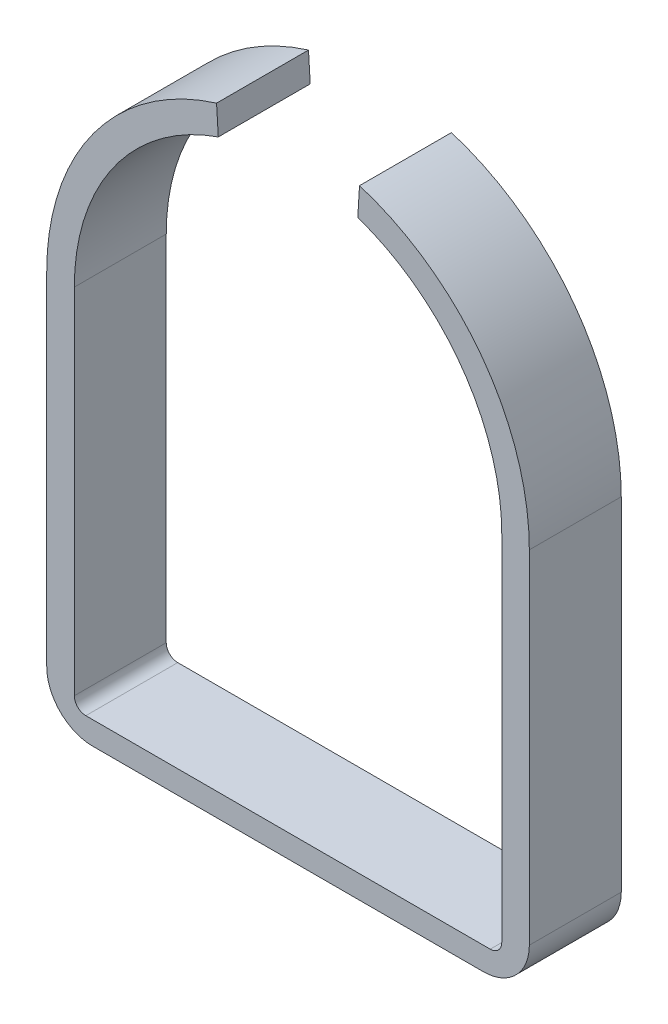
ISO-10303-21;
HEADER;
FILE_DESCRIPTION(('STEP AP214'),'2;1');
FILE_NAME('part.step','',(''),(''),'','','');
FILE_SCHEMA(('AUTOMOTIVE_DESIGN { 1 0 10303 214 1 1 1 1 }'));
ENDSEC;
DATA;
#1=APPLICATION_CONTEXT('core data for automotive mechanical design processes');
#2=APPLICATION_PROTOCOL_DEFINITION('international standard','automotive_design',2000,#1);
#3=PRODUCT_CONTEXT('',#1,'mechanical');
#4=PRODUCT('Part','Part','',(#3));
#5=PRODUCT_RELATED_PRODUCT_CATEGORY('part','',(#4));
#6=PRODUCT_DEFINITION_FORMATION('','',#4);
#7=PRODUCT_DEFINITION_CONTEXT('part definition',#1,'design');
#8=PRODUCT_DEFINITION('design','',#6,#7);
#9=PRODUCT_DEFINITION_SHAPE('','',#8);
#10=(LENGTH_UNIT() NAMED_UNIT(*) SI_UNIT(.MILLI.,.METRE.));
#11=(NAMED_UNIT(*) PLANE_ANGLE_UNIT() SI_UNIT($,.RADIAN.));
#12=(NAMED_UNIT(*) SI_UNIT($,.STERADIAN.) SOLID_ANGLE_UNIT());
#13=UNCERTAINTY_MEASURE_WITH_UNIT(LENGTH_MEASURE(1.E-05),#10,'distance_accuracy_value','');
#14=(GEOMETRIC_REPRESENTATION_CONTEXT(3) GLOBAL_UNCERTAINTY_ASSIGNED_CONTEXT((#13)) GLOBAL_UNIT_ASSIGNED_CONTEXT((#10,
#11,#12)) REPRESENTATION_CONTEXT('',''));
#15=CARTESIAN_POINT('',(0.,0.,0.));
#16=DIRECTION('',(0.,0.,1.));
#17=DIRECTION('',(1.,0.,0.));
#18=AXIS2_PLACEMENT_3D('',#15,#16,#17);
#19=CARTESIAN_POINT('',(0.,0.,56.8469714478884));
#20=DIRECTION('',(0.,0.,-1.));
#21=DIRECTION('',(-1.,0.,0.));
#22=AXIS2_PLACEMENT_3D('',#19,#20,#21);
#23=CYLINDRICAL_SURFACE('',#22,9.3);
#24=DIRECTION('',(0.,0.,-1.));
#25=VECTOR('',#24,1.);
#26=CARTESIAN_POINT('',(3.03467311666204,8.79094756411439,56.8469714478884));
#27=LINE('',#26,#25);
#28=CARTESIAN_POINT('',(3.03467311666204,8.79094756411439,1.5));
#29=VERTEX_POINT('',#28);
#30=CARTESIAN_POINT('',(3.03467311666204,8.79094756411439,5.5));
#31=VERTEX_POINT('',#30);
#32=EDGE_CURVE('E218',#29,#31,#27,.F.);
#33=ORIENTED_EDGE('',*,*,#32,.F.);
#34=CARTESIAN_POINT('',(0.,0.,1.5));
#35=DIRECTION('',(0.,0.,1.));
#36=DIRECTION('',(-1.,0.,0.));
#37=AXIS2_PLACEMENT_3D('',#34,#35,#36);
#38=CIRCLE('',#37,9.3);
#39=CARTESIAN_POINT('',(9.3,0.,1.5));
#40=VERTEX_POINT('',#39);
#41=EDGE_CURVE('E205',#40,#29,#38,.T.);
#42=ORIENTED_EDGE('',*,*,#41,.F.);
#43=DIRECTION('',(0.,0.,-1.));
#44=VECTOR('',#43,1.);
#45=CARTESIAN_POINT('',(9.3,0.,56.8469714478884));
#46=LINE('',#45,#44);
#47=CARTESIAN_POINT('',(9.3,0.,5.5));
#48=VERTEX_POINT('',#47);
#49=EDGE_CURVE('E266',#48,#40,#46,.T.);
#50=ORIENTED_EDGE('',*,*,#49,.F.);
#51=CARTESIAN_POINT('',(0.,0.,5.5));
#52=DIRECTION('',(0.,0.,1.));
#53=DIRECTION('',(1.,0.,0.));
#54=AXIS2_PLACEMENT_3D('',#51,#52,#53);
#55=CIRCLE('',#54,9.3);
#56=EDGE_CURVE('E231',#48,#31,#55,.T.);
#57=ORIENTED_EDGE('',*,*,#56,.T.);
#58=EDGE_LOOP('',(#33,#42,#50,#57));
#59=FACE_BOUND('',#58,.T.);
#60=ADVANCED_FACE('F44',(#59),#23,.F.);
#61=CARTESIAN_POINT('',(0.,0.,5.5));
#62=DIRECTION('',(0.,0.,1.));
#63=DIRECTION('',(1.,0.,0.));
#64=AXIS2_PLACEMENT_3D('',#61,#62,#63);
#65=PLANE('',#64);
#66=DIRECTION('',(0.,-1.,0.));
#67=VECTOR('',#66,1.);
#68=CARTESIAN_POINT('',(-10.5,0.,5.5));
#69=LINE('',#68,#67);
#70=CARTESIAN_POINT('',(-10.5,0.,5.5));
#71=VERTEX_POINT('',#70);
#72=CARTESIAN_POINT('',(-10.5,-14.900343897342,5.5));
#73=VERTEX_POINT('',#72);
#74=EDGE_CURVE('E174',#71,#73,#69,.T.);
#75=ORIENTED_EDGE('',*,*,#74,.T.);
#76=CARTESIAN_POINT('',(-8.5,-14.900343897342,5.5));
#77=DIRECTION('',(0.,0.,1.));
#78=DIRECTION('',(1.,0.,0.));
#79=AXIS2_PLACEMENT_3D('',#76,#77,#78);
#80=CIRCLE('',#79,2.);
#81=CARTESIAN_POINT('',(-8.5,-16.900343897342,5.5));
#82=VERTEX_POINT('',#81);
#83=EDGE_CURVE('E274',#73,#82,#80,.T.);
#84=ORIENTED_EDGE('',*,*,#83,.T.);
#85=DIRECTION('',(-1.,0.,0.));
#86=VECTOR('',#85,1.);
#87=CARTESIAN_POINT('',(-11.1726993556512,-16.900343897342,5.5));
#88=LINE('',#87,#86);
#89=CARTESIAN_POINT('',(8.5,-16.900343897342,5.5));
#90=VERTEX_POINT('',#89);
#91=EDGE_CURVE('E168',#90,#82,#88,.T.);
#92=ORIENTED_EDGE('',*,*,#91,.F.);
#93=CARTESIAN_POINT('',(8.5,-14.900343897342,5.5));
#94=DIRECTION('',(0.,0.,1.));
#95=DIRECTION('',(1.,0.,0.));
#96=AXIS2_PLACEMENT_3D('',#93,#94,#95);
#97=CIRCLE('',#96,2.);
#98=CARTESIAN_POINT('',(10.5,-14.900343897342,5.5));
#99=VERTEX_POINT('',#98);
#100=EDGE_CURVE('E272',#90,#99,#97,.T.);
#101=ORIENTED_EDGE('',*,*,#100,.T.);
#102=DIRECTION('',(0.,-1.,0.));
#103=VECTOR('',#102,1.);
#104=CARTESIAN_POINT('',(10.5,0.,5.5));
#105=LINE('',#104,#103);
#106=CARTESIAN_POINT('',(10.5,0.,5.5));
#107=VERTEX_POINT('',#106);
#108=EDGE_CURVE('E235',#107,#99,#105,.T.);
#109=ORIENTED_EDGE('',*,*,#108,.F.);
#110=CARTESIAN_POINT('',(0.,0.,5.5));
#111=DIRECTION('',(0.,0.,1.));
#112=DIRECTION('',(1.,0.,0.));
#113=AXIS2_PLACEMENT_3D('',#110,#111,#112);
#114=CIRCLE('',#113,10.5);
#115=CARTESIAN_POINT('',(3.11032664956738,10.0287520725657,5.5));
#116=VERTEX_POINT('',#115);
#117=EDGE_CURVE('E237',#116,#107,#114,.F.);
#118=ORIENTED_EDGE('',*,*,#117,.F.);
#119=DIRECTION('',(-0.0610052906976046,-0.998137442693591,0.));
#120=VECTOR('',#119,1.);
#121=CARTESIAN_POINT('',(2.48808370636675,-0.15206950796001,5.5));
#122=LINE('',#121,#120);
#123=EDGE_CURVE('E242',#116,#31,#122,.T.);
#124=ORIENTED_EDGE('',*,*,#123,.T.);
#125=ORIENTED_EDGE('',*,*,#56,.F.);
#126=DIRECTION('',(0.,1.,0.));
#127=VECTOR('',#126,1.);
#128=CARTESIAN_POINT('',(9.3,0.,5.5));
#129=LINE('',#128,#127);
#130=CARTESIAN_POINT('',(9.3,-15.4,5.5));
#131=VERTEX_POINT('',#130);
#132=EDGE_CURVE('E229',#131,#48,#129,.T.);
#133=ORIENTED_EDGE('',*,*,#132,.F.);
#134=CARTESIAN_POINT('',(8.8,-15.4,5.5));
#135=DIRECTION('',(0.,0.,1.));
#136=DIRECTION('',(1.,0.,0.));
#137=AXIS2_PLACEMENT_3D('',#134,#135,#136);
#138=CIRCLE('',#137,0.5);
#139=CARTESIAN_POINT('',(8.8,-15.9,5.5));
#140=VERTEX_POINT('',#139);
#141=EDGE_CURVE('E248',#131,#140,#138,.F.);
#142=ORIENTED_EDGE('',*,*,#141,.T.);
#143=DIRECTION('',(1.,0.,0.));
#144=VECTOR('',#143,1.);
#145=CARTESIAN_POINT('',(0.,-15.9,5.5));
#146=LINE('',#145,#144);
#147=CARTESIAN_POINT('',(-8.8,-15.9,5.5));
#148=VERTEX_POINT('',#147);
#149=EDGE_CURVE('E226',#148,#140,#146,.T.);
#150=ORIENTED_EDGE('',*,*,#149,.F.);
#151=CARTESIAN_POINT('',(-8.8,-15.4,5.5));
#152=DIRECTION('',(0.,0.,1.));
#153=DIRECTION('',(1.,0.,0.));
#154=AXIS2_PLACEMENT_3D('',#151,#152,#153);
#155=CIRCLE('',#154,0.5);
#156=CARTESIAN_POINT('',(-9.3,-15.4,5.5));
#157=VERTEX_POINT('',#156);
#158=EDGE_CURVE('E221',#148,#157,#155,.F.);
#159=ORIENTED_EDGE('',*,*,#158,.T.);
#160=DIRECTION('',(0.,-1.,0.));
#161=VECTOR('',#160,1.);
#162=CARTESIAN_POINT('',(-9.3,-15.9,5.5));
#163=LINE('',#162,#161);
#164=CARTESIAN_POINT('',(-9.3,0.,5.5));
#165=VERTEX_POINT('',#164);
#166=EDGE_CURVE('E222',#165,#157,#163,.T.);
#167=ORIENTED_EDGE('',*,*,#166,.F.);
#168=CARTESIAN_POINT('',(-3.03467311644218,8.79094756419029,5.5));
#169=VERTEX_POINT('',#168);
#170=EDGE_CURVE('E234',#169,#165,#55,.T.);
#171=ORIENTED_EDGE('',*,*,#170,.F.);
#172=DIRECTION('',(-0.0610052909139107,0.99813744268037,0.));
#173=VECTOR('',#172,1.);
#174=CARTESIAN_POINT('',(-2.48808370417207,-0.152069508367079,5.5));
#175=LINE('',#174,#173);
#176=CARTESIAN_POINT('',(-3.11032664961128,10.0287520725521,5.5));
#177=VERTEX_POINT('',#176);
#178=EDGE_CURVE('E244',#169,#177,#175,.T.);
#179=ORIENTED_EDGE('',*,*,#178,.T.);
#180=CARTESIAN_POINT('',(0.,0.,5.5));
#181=DIRECTION('',(0.,0.,1.));
#182=DIRECTION('',(1.,0.,0.));
#183=AXIS2_PLACEMENT_3D('',#180,#181,#182);
#184=CIRCLE('',#183,10.5);
#185=EDGE_CURVE('E240',#71,#177,#184,.F.);
#186=ORIENTED_EDGE('',*,*,#185,.F.);
#187=EDGE_LOOP('',(#75,#84,#92,#101,#109,#118,#124,#125,#133,#142,#150,#159,#167,#171,#179,#186));
#188=FACE_BOUND('',#187,.T.);
#189=ADVANCED_FACE('F290',(#188),#65,.T.);
#190=DIRECTION('',(0.,0.,-1.));
#191=VECTOR('',#190,1.);
#192=CARTESIAN_POINT('',(-3.03467311644218,8.79094756419029,56.8469714478884));
#193=LINE('',#192,#191);
#194=CARTESIAN_POINT('',(-3.03467311644218,8.79094756419029,1.5));
#195=VERTEX_POINT('',#194);
#196=EDGE_CURVE('E216',#169,#195,#193,.T.);
#197=ORIENTED_EDGE('',*,*,#196,.F.);
#198=ORIENTED_EDGE('',*,*,#170,.T.);
#199=DIRECTION('',(0.,0.,-1.));
#200=VECTOR('',#199,1.);
#201=CARTESIAN_POINT('',(-9.3,0.,56.8469714478884));
#202=LINE('',#201,#200);
#203=CARTESIAN_POINT('',(-9.3,0.,1.5));
#204=VERTEX_POINT('',#203);
#205=EDGE_CURVE('E178',#165,#204,#202,.T.);
#206=ORIENTED_EDGE('',*,*,#205,.T.);
#207=CARTESIAN_POINT('',(0.,0.,1.5));
#208=DIRECTION('',(0.,0.,1.));
#209=DIRECTION('',(-1.,0.,0.));
#210=AXIS2_PLACEMENT_3D('',#207,#208,#209);
#211=CIRCLE('',#210,9.3);
#212=EDGE_CURVE('E184',#195,#204,#211,.T.);
#213=ORIENTED_EDGE('',*,*,#212,.F.);
#214=EDGE_LOOP('',(#197,#198,#206,#213));
#215=FACE_BOUND('',#214,.T.);
#216=ADVANCED_FACE('F298',(#215),#23,.F.);
#217=CARTESIAN_POINT('',(-9.3,-15.9,56.8469714478884));
#218=DIRECTION('',(1.,0.,0.));
#219=DIRECTION('',(0.,0.,-1.));
#220=AXIS2_PLACEMENT_3D('',#217,#218,#219);
#221=PLANE('',#220);
#222=DIRECTION('',(0.,0.,-1.));
#223=VECTOR('',#222,1.);
#224=CARTESIAN_POINT('',(-9.3,-15.4,0.));
#225=LINE('',#224,#223);
#226=CARTESIAN_POINT('',(-9.3,-15.4,1.5));
#227=VERTEX_POINT('',#226);
#228=EDGE_CURVE('E225',#157,#227,#225,.T.);
#229=ORIENTED_EDGE('',*,*,#228,.T.);
#230=DIRECTION('',(0.,-1.,0.));
#231=VECTOR('',#230,1.);
#232=CARTESIAN_POINT('',(-9.3,0.,1.5));
#233=LINE('',#232,#231);
#234=EDGE_CURVE('E190',#204,#227,#233,.T.);
#235=ORIENTED_EDGE('',*,*,#234,.F.);
#236=ORIENTED_EDGE('',*,*,#205,.F.);
#237=ORIENTED_EDGE('',*,*,#166,.T.);
#238=EDGE_LOOP('',(#229,#235,#236,#237));
#239=FACE_BOUND('',#238,.T.);
#240=ADVANCED_FACE('F303',(#239),#221,.T.);
#241=CARTESIAN_POINT('',(0.,-15.9,56.8469714478884));
#242=DIRECTION('',(0.,1.,0.));
#243=DIRECTION('',(0.,0.,1.));
#244=AXIS2_PLACEMENT_3D('',#241,#242,#243);
#245=PLANE('',#244);
#246=DIRECTION('',(0.,0.,-1.));
#247=VECTOR('',#246,1.);
#248=CARTESIAN_POINT('',(8.8,-15.9,0.));
#249=LINE('',#248,#247);
#250=CARTESIAN_POINT('',(8.8,-15.9,1.5));
#251=VERTEX_POINT('',#250);
#252=EDGE_CURVE('E256',#140,#251,#249,.T.);
#253=ORIENTED_EDGE('',*,*,#252,.T.);
#254=DIRECTION('',(1.,0.,0.));
#255=VECTOR('',#254,1.);
#256=CARTESIAN_POINT('',(-8.8,-15.9,1.5));
#257=LINE('',#256,#255);
#258=CARTESIAN_POINT('',(-8.8,-15.9,1.5));
#259=VERTEX_POINT('',#258);
#260=EDGE_CURVE('E196',#259,#251,#257,.T.);
#261=ORIENTED_EDGE('',*,*,#260,.F.);
#262=DIRECTION('',(0.,0.,-1.));
#263=VECTOR('',#262,1.);
#264=CARTESIAN_POINT('',(-8.8,-15.9,6.02159565602451));
#265=LINE('',#264,#263);
#266=EDGE_CURVE('E258',#259,#148,#265,.F.);
#267=ORIENTED_EDGE('',*,*,#266,.T.);
#268=ORIENTED_EDGE('',*,*,#149,.T.);
#269=EDGE_LOOP('',(#253,#261,#267,#268));
#270=FACE_BOUND('',#269,.T.);
#271=ADVANCED_FACE('F310',(#270),#245,.T.);
#272=CARTESIAN_POINT('',(-8.8,-15.4,56.8469714478884));
#273=DIRECTION('',(0.,0.,1.));
#274=DIRECTION('',(1.,0.,0.));
#275=AXIS2_PLACEMENT_3D('',#272,#273,#274);
#276=CYLINDRICAL_SURFACE('',#275,0.5);
#277=ORIENTED_EDGE('',*,*,#266,.F.);
#278=CARTESIAN_POINT('',(-8.8,-15.4,1.5));
#279=DIRECTION('',(0.,0.,1.));
#280=DIRECTION('',(-1.,0.,0.));
#281=AXIS2_PLACEMENT_3D('',#278,#279,#280);
#282=CIRCLE('',#281,0.5);
#283=EDGE_CURVE('E193',#227,#259,#282,.T.);
#284=ORIENTED_EDGE('',*,*,#283,.F.);
#285=ORIENTED_EDGE('',*,*,#228,.F.);
#286=ORIENTED_EDGE('',*,*,#158,.F.);
#287=EDGE_LOOP('',(#277,#284,#285,#286));
#288=FACE_BOUND('',#287,.T.);
#289=ADVANCED_FACE('F306',(#288),#276,.F.);
#290=CARTESIAN_POINT('',(9.3,0.,56.8469714478884));
#291=DIRECTION('',(-1.,0.,0.));
#292=DIRECTION('',(0.,-1.,0.));
#293=AXIS2_PLACEMENT_3D('',#290,#291,#292);
#294=PLANE('',#293);
#295=ORIENTED_EDGE('',*,*,#49,.T.);
#296=DIRECTION('',(0.,1.,0.));
#297=VECTOR('',#296,1.);
#298=CARTESIAN_POINT('',(9.3,-15.4,1.5));
#299=LINE('',#298,#297);
#300=CARTESIAN_POINT('',(9.3,-15.4,1.5));
#301=VERTEX_POINT('',#300);
#302=EDGE_CURVE('E202',#301,#40,#299,.T.);
#303=ORIENTED_EDGE('',*,*,#302,.F.);
#304=DIRECTION('',(0.,0.,-1.));
#305=VECTOR('',#304,1.);
#306=CARTESIAN_POINT('',(9.3,-15.4,6.0215956560245));
#307=LINE('',#306,#305);
#308=EDGE_CURVE('E254',#301,#131,#307,.F.);
#309=ORIENTED_EDGE('',*,*,#308,.T.);
#310=ORIENTED_EDGE('',*,*,#132,.T.);
#311=EDGE_LOOP('',(#295,#303,#309,#310));
#312=FACE_BOUND('',#311,.T.);
#313=ADVANCED_FACE('F318',(#312),#294,.T.);
#314=CARTESIAN_POINT('',(8.8,-15.4,56.8469714478884));
#315=DIRECTION('',(0.,0.,1.));
#316=DIRECTION('',(1.,0.,0.));
#317=AXIS2_PLACEMENT_3D('',#314,#315,#316);
#318=CYLINDRICAL_SURFACE('',#317,0.5);
#319=ORIENTED_EDGE('',*,*,#308,.F.);
#320=CARTESIAN_POINT('',(8.8,-15.4,1.5));
#321=DIRECTION('',(0.,0.,1.));
#322=DIRECTION('',(-1.,0.,0.));
#323=AXIS2_PLACEMENT_3D('',#320,#321,#322);
#324=CIRCLE('',#323,0.5);
#325=EDGE_CURVE('E199',#251,#301,#324,.T.);
#326=ORIENTED_EDGE('',*,*,#325,.F.);
#327=ORIENTED_EDGE('',*,*,#252,.F.);
#328=ORIENTED_EDGE('',*,*,#141,.F.);
#329=EDGE_LOOP('',(#319,#326,#327,#328));
#330=FACE_BOUND('',#329,.T.);
#331=ADVANCED_FACE('F314',(#330),#318,.F.);
#332=CARTESIAN_POINT('',(2.48808370636675,-0.15206950796001,7.65));
#333=DIRECTION('',(0.998137442693591,-0.0610052906976046,0.));
#334=DIRECTION('',(0.0610052906976046,0.998137442693591,0.));
#335=AXIS2_PLACEMENT_3D('',#332,#333,#334);
#336=PLANE('',#335);
#337=DIRECTION('',(0.,0.,-1.));
#338=VECTOR('',#337,1.);
#339=CARTESIAN_POINT('',(3.11032664956738,10.0287520725657,7.65));
#340=LINE('',#339,#338);
#341=CARTESIAN_POINT('',(3.11032664956738,10.0287520725657,1.5));
#342=VERTEX_POINT('',#341);
#343=EDGE_CURVE('E262',#116,#342,#340,.T.);
#344=ORIENTED_EDGE('',*,*,#343,.T.);
#345=DIRECTION('',(0.0610052906976045,0.998137442693591,0.));
#346=VECTOR('',#345,1.);
#347=CARTESIAN_POINT('',(3.03467311666204,8.79094756411439,1.5));
#348=LINE('',#347,#346);
#349=EDGE_CURVE('E208',#29,#342,#348,.T.);
#350=ORIENTED_EDGE('',*,*,#349,.F.);
#351=ORIENTED_EDGE('',*,*,#32,.T.);
#352=ORIENTED_EDGE('',*,*,#123,.F.);
#353=EDGE_LOOP('',(#344,#350,#351,#352));
#354=FACE_BOUND('',#353,.T.);
#355=ADVANCED_FACE('F326',(#354),#336,.F.);
#356=CARTESIAN_POINT('',(0.,0.,7.65));
#357=DIRECTION('',(0.,0.,-1.));
#358=DIRECTION('',(-1.,0.,0.));
#359=AXIS2_PLACEMENT_3D('',#356,#357,#358);
#360=CYLINDRICAL_SURFACE('',#359,10.5);
#361=DIRECTION('',(0.,0.,-1.));
#362=VECTOR('',#361,1.);
#363=CARTESIAN_POINT('',(-3.11032664961128,10.0287520725521,7.65));
#364=LINE('',#363,#362);
#365=CARTESIAN_POINT('',(-3.11032664961128,10.0287520725521,1.5));
#366=VERTEX_POINT('',#365);
#367=EDGE_CURVE('E179',#177,#366,#364,.T.);
#368=ORIENTED_EDGE('',*,*,#367,.T.);
#369=CARTESIAN_POINT('',(0.,0.,1.5));
#370=DIRECTION('',(0.,0.,-1.));
#371=DIRECTION('',(-1.,0.,0.));
#372=AXIS2_PLACEMENT_3D('',#369,#370,#371);
#373=CIRCLE('',#372,10.5);
#374=CARTESIAN_POINT('',(-10.5,0.,1.5));
#375=VERTEX_POINT('',#374);
#376=EDGE_CURVE('E162',#375,#366,#373,.T.);
#377=ORIENTED_EDGE('',*,*,#376,.F.);
#378=DIRECTION('',(0.,0.,-1.));
#379=VECTOR('',#378,1.);
#380=CARTESIAN_POINT('',(-10.5,0.,7.65));
#381=LINE('',#380,#379);
#382=EDGE_CURVE('E171',#71,#375,#381,.T.);
#383=ORIENTED_EDGE('',*,*,#382,.F.);
#384=ORIENTED_EDGE('',*,*,#185,.T.);
#385=EDGE_LOOP('',(#368,#377,#383,#384));
#386=FACE_BOUND('',#385,.T.);
#387=ADVANCED_FACE('F181',(#386),#360,.T.);
#388=CARTESIAN_POINT('',(-10.5,0.,7.65));
#389=DIRECTION('',(1.,0.,0.));
#390=DIRECTION('',(0.,0.,-1.));
#391=AXIS2_PLACEMENT_3D('',#388,#389,#390);
#392=PLANE('',#391);
#393=DIRECTION('',(0.,1.,0.));
#394=VECTOR('',#393,1.);
#395=CARTESIAN_POINT('',(-10.5,-17.,1.5));
#396=LINE('',#395,#394);
#397=CARTESIAN_POINT('',(-10.5,-14.900343897342,1.5));
#398=VERTEX_POINT('',#397);
#399=EDGE_CURVE('E157',#398,#375,#396,.T.);
#400=ORIENTED_EDGE('',*,*,#399,.F.);
#401=DIRECTION('',(0.,0.,1.));
#402=VECTOR('',#401,1.);
#403=CARTESIAN_POINT('',(-10.5,-14.900343897342,7.65));
#404=LINE('',#403,#402);
#405=EDGE_CURVE('E270',#398,#73,#404,.T.);
#406=ORIENTED_EDGE('',*,*,#405,.T.);
#407=ORIENTED_EDGE('',*,*,#74,.F.);
#408=ORIENTED_EDGE('',*,*,#382,.T.);
#409=EDGE_LOOP('',(#400,#406,#407,#408));
#410=FACE_BOUND('',#409,.T.);
#411=ADVANCED_FACE('F172',(#410),#392,.F.);
#412=DIRECTION('',(0.,0.,-1.));
#413=VECTOR('',#412,1.);
#414=CARTESIAN_POINT('',(10.5,0.,7.65));
#415=LINE('',#414,#413);
#416=CARTESIAN_POINT('',(10.5,0.,1.5));
#417=VERTEX_POINT('',#416);
#418=EDGE_CURVE('E260',#107,#417,#415,.T.);
#419=ORIENTED_EDGE('',*,*,#418,.T.);
#420=CARTESIAN_POINT('',(0.,0.,1.5));
#421=DIRECTION('',(0.,0.,-1.));
#422=DIRECTION('',(-1.,0.,0.));
#423=AXIS2_PLACEMENT_3D('',#420,#421,#422);
#424=CIRCLE('',#423,10.5);
#425=EDGE_CURVE('E211',#342,#417,#424,.T.);
#426=ORIENTED_EDGE('',*,*,#425,.F.);
#427=ORIENTED_EDGE('',*,*,#343,.F.);
#428=ORIENTED_EDGE('',*,*,#117,.T.);
#429=EDGE_LOOP('',(#419,#426,#427,#428));
#430=FACE_BOUND('',#429,.T.);
#431=ADVANCED_FACE('F330',(#430),#360,.T.);
#432=CARTESIAN_POINT('',(10.5,0.,7.65));
#433=DIRECTION('',(1.,0.,0.));
#434=DIRECTION('',(0.,1.,0.));
#435=AXIS2_PLACEMENT_3D('',#432,#433,#434);
#436=PLANE('',#435);
#437=ORIENTED_EDGE('',*,*,#108,.T.);
#438=DIRECTION('',(0.,0.,1.));
#439=VECTOR('',#438,1.);
#440=CARTESIAN_POINT('',(10.5,-14.900343897342,1.5));
#441=LINE('',#440,#439);
#442=CARTESIAN_POINT('',(10.5,-14.900343897342,1.5));
#443=VERTEX_POINT('',#442);
#444=EDGE_CURVE('E11',#99,#443,#441,.F.);
#445=ORIENTED_EDGE('',*,*,#444,.T.);
#446=DIRECTION('',(0.,-1.,0.));
#447=VECTOR('',#446,1.);
#448=CARTESIAN_POINT('',(10.5,0.,1.5));
#449=LINE('',#448,#447);
#450=EDGE_CURVE('E214',#417,#443,#449,.T.);
#451=ORIENTED_EDGE('',*,*,#450,.F.);
#452=ORIENTED_EDGE('',*,*,#418,.F.);
#453=EDGE_LOOP('',(#437,#445,#451,#452));
#454=FACE_BOUND('',#453,.T.);
#455=ADVANCED_FACE('F332',(#454),#436,.T.);
#456=CARTESIAN_POINT('',(-2.48808370417207,-0.152069508367079,7.65));
#457=DIRECTION('',(-0.99813744268037,-0.0610052909139107,0.));
#458=DIRECTION('',(0.0610052909139107,-0.99813744268037,0.));
#459=AXIS2_PLACEMENT_3D('',#456,#457,#458);
#460=PLANE('',#459);
#461=ORIENTED_EDGE('',*,*,#178,.F.);
#462=ORIENTED_EDGE('',*,*,#196,.T.);
#463=DIRECTION('',(0.0610052909138892,-0.998137442680372,0.));
#464=VECTOR('',#463,1.);
#465=CARTESIAN_POINT('',(-3.11032664961128,10.0287520725521,1.5));
#466=LINE('',#465,#464);
#467=EDGE_CURVE('E182',#366,#195,#466,.T.);
#468=ORIENTED_EDGE('',*,*,#467,.F.);
#469=ORIENTED_EDGE('',*,*,#367,.F.);
#470=EDGE_LOOP('',(#461,#462,#468,#469));
#471=FACE_BOUND('',#470,.T.);
#472=ADVANCED_FACE('F295',(#471),#460,.F.);
#473=CARTESIAN_POINT('',(9.35000000018532,-17.0923044276493,1.5));
#474=DIRECTION('',(0.,0.,-1.));
#475=DIRECTION('',(-1.,0.,0.));
#476=AXIS2_PLACEMENT_3D('',#473,#474,#475);
#477=PLANE('',#476);
#478=DIRECTION('',(1.,0.,0.));
#479=VECTOR('',#478,1.);
#480=CARTESIAN_POINT('',(9.35000000018532,-16.900343897342,1.5));
#481=LINE('',#480,#479);
#482=CARTESIAN_POINT('',(-8.5,-16.900343897342,1.5));
#483=VERTEX_POINT('',#482);
#484=CARTESIAN_POINT('',(8.5,-16.900343897342,1.5));
#485=VERTEX_POINT('',#484);
#486=EDGE_CURVE('E268',#483,#485,#481,.T.);
#487=ORIENTED_EDGE('',*,*,#486,.F.);
#488=CARTESIAN_POINT('',(-8.5,-14.900343897342,1.5));
#489=DIRECTION('',(0.,0.,-1.));
#490=DIRECTION('',(-1.,0.,0.));
#491=AXIS2_PLACEMENT_3D('',#488,#489,#490);
#492=CIRCLE('',#491,2.);
#493=EDGE_CURVE('E52',#483,#398,#492,.T.);
#494=ORIENTED_EDGE('',*,*,#493,.T.);
#495=ORIENTED_EDGE('',*,*,#399,.T.);
#496=ORIENTED_EDGE('',*,*,#376,.T.);
#497=ORIENTED_EDGE('',*,*,#467,.T.);
#498=ORIENTED_EDGE('',*,*,#212,.T.);
#499=ORIENTED_EDGE('',*,*,#234,.T.);
#500=ORIENTED_EDGE('',*,*,#283,.T.);
#501=ORIENTED_EDGE('',*,*,#260,.T.);
#502=ORIENTED_EDGE('',*,*,#325,.T.);
#503=ORIENTED_EDGE('',*,*,#302,.T.);
#504=ORIENTED_EDGE('',*,*,#41,.T.);
#505=ORIENTED_EDGE('',*,*,#349,.T.);
#506=ORIENTED_EDGE('',*,*,#425,.T.);
#507=ORIENTED_EDGE('',*,*,#450,.T.);
#508=CARTESIAN_POINT('',(8.5,-14.900343897342,1.5));
#509=DIRECTION('',(0.,0.,-1.));
#510=DIRECTION('',(-1.,0.,0.));
#511=AXIS2_PLACEMENT_3D('',#508,#509,#510);
#512=CIRCLE('',#511,2.);
#513=EDGE_CURVE('E64',#443,#485,#512,.T.);
#514=ORIENTED_EDGE('',*,*,#513,.T.);
#515=EDGE_LOOP('',(#487,#494,#495,#496,#497,#498,#499,#500,#501,#502,#503,#504,#505,#506,#507,#514));
#516=FACE_BOUND('',#515,.T.);
#517=ADVANCED_FACE('F159',(#516),#477,.T.);
#518=CARTESIAN_POINT('',(-11.1726993556512,-16.900343897342,-4.5));
#519=DIRECTION('',(0.,1.,0.));
#520=DIRECTION('',(0.,0.,1.));
#521=AXIS2_PLACEMENT_3D('',#518,#519,#520);
#522=PLANE('',#521);
#523=ORIENTED_EDGE('',*,*,#91,.T.);
#524=DIRECTION('',(0.,0.,1.));
#525=VECTOR('',#524,1.);
#526=CARTESIAN_POINT('',(-8.5,-16.900343897342,-4.5));
#527=LINE('',#526,#525);
#528=EDGE_CURVE('E279',#82,#483,#527,.F.);
#529=ORIENTED_EDGE('',*,*,#528,.T.);
#530=ORIENTED_EDGE('',*,*,#486,.T.);
#531=DIRECTION('',(0.,0.,1.));
#532=VECTOR('',#531,1.);
#533=CARTESIAN_POINT('',(8.5,-16.900343897342,5.5));
#534=LINE('',#533,#532);
#535=EDGE_CURVE('E276',#485,#90,#534,.T.);
#536=ORIENTED_EDGE('',*,*,#535,.T.);
#537=EDGE_LOOP('',(#523,#529,#530,#536));
#538=FACE_BOUND('',#537,.T.);
#539=ADVANCED_FACE('F284',(#538),#522,.F.);
#540=CARTESIAN_POINT('',(-8.5,-14.900343897342,7.65));
#541=DIRECTION('',(0.,0.,1.));
#542=DIRECTION('',(1.,0.,0.));
#543=AXIS2_PLACEMENT_3D('',#540,#541,#542);
#544=CYLINDRICAL_SURFACE('',#543,2.);
#545=ORIENTED_EDGE('',*,*,#493,.F.);
#546=ORIENTED_EDGE('',*,*,#528,.F.);
#547=ORIENTED_EDGE('',*,*,#83,.F.);
#548=ORIENTED_EDGE('',*,*,#405,.F.);
#549=EDGE_LOOP('',(#545,#546,#547,#548));
#550=FACE_BOUND('',#549,.T.);
#551=ADVANCED_FACE('F288',(#550),#544,.T.);
#552=CARTESIAN_POINT('',(8.5,-14.900343897342,-4.5));
#553=DIRECTION('',(0.,0.,-1.));
#554=DIRECTION('',(-1.,0.,0.));
#555=AXIS2_PLACEMENT_3D('',#552,#553,#554);
#556=CYLINDRICAL_SURFACE('',#555,2.);
#557=ORIENTED_EDGE('',*,*,#513,.F.);
#558=ORIENTED_EDGE('',*,*,#444,.F.);
#559=ORIENTED_EDGE('',*,*,#100,.F.);
#560=ORIENTED_EDGE('',*,*,#535,.F.);
#561=EDGE_LOOP('',(#557,#558,#559,#560));
#562=FACE_BOUND('',#561,.T.);
#563=ADVANCED_FACE('F46',(#562),#556,.T.);
#564=CLOSED_SHELL('',(#60,#189,#216,#240,#271,#289,#313,#331,#355,#387,#411,#431,#455,#472,#517,
#539,#551,#563));
#565=MANIFOLD_SOLID_BREP('B2',#564);
#566=ADVANCED_BREP_SHAPE_REPRESENTATION('',(#18,#565),#14);
#567=SHAPE_DEFINITION_REPRESENTATION(#9,#566);
ENDSEC;
END-ISO-10303-21;
